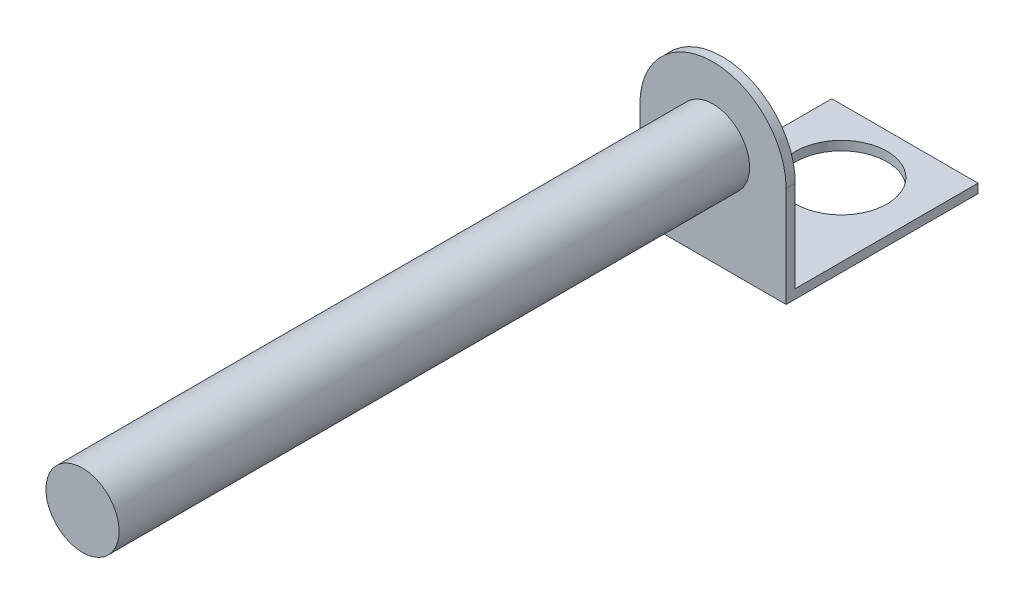
ISO-10303-21;
HEADER;
FILE_DESCRIPTION(('STEP AP214'),'2;1');
FILE_NAME('part.step','',(''),(''),'','','');
FILE_SCHEMA(('AUTOMOTIVE_DESIGN { 1 0 10303 214 1 1 1 1 }'));
ENDSEC;
DATA;
#1=APPLICATION_CONTEXT('core data for automotive mechanical design processes');
#2=APPLICATION_PROTOCOL_DEFINITION('international standard','automotive_design',2000,#1);
#3=PRODUCT_CONTEXT('',#1,'mechanical');
#4=PRODUCT('Part','Part','',(#3));
#5=PRODUCT_RELATED_PRODUCT_CATEGORY('part','',(#4));
#6=PRODUCT_DEFINITION_FORMATION('','',#4);
#7=PRODUCT_DEFINITION_CONTEXT('part definition',#1,'design');
#8=PRODUCT_DEFINITION('design','',#6,#7);
#9=PRODUCT_DEFINITION_SHAPE('','',#8);
#10=(LENGTH_UNIT() NAMED_UNIT(*) SI_UNIT(.MILLI.,.METRE.));
#11=(NAMED_UNIT(*) PLANE_ANGLE_UNIT() SI_UNIT($,.RADIAN.));
#12=(NAMED_UNIT(*) SI_UNIT($,.STERADIAN.) SOLID_ANGLE_UNIT());
#13=UNCERTAINTY_MEASURE_WITH_UNIT(LENGTH_MEASURE(1.E-05),#10,'distance_accuracy_value','');
#14=(GEOMETRIC_REPRESENTATION_CONTEXT(3) GLOBAL_UNCERTAINTY_ASSIGNED_CONTEXT((#13)) GLOBAL_UNIT_ASSIGNED_CONTEXT((#10,
#11,#12)) REPRESENTATION_CONTEXT('',''));
#15=CARTESIAN_POINT('',(0.,0.,0.));
#16=DIRECTION('',(0.,0.,1.));
#17=DIRECTION('',(1.,0.,0.));
#18=AXIS2_PLACEMENT_3D('',#15,#16,#17);
#19=CARTESIAN_POINT('',(0.,0.,69.));
#20=DIRECTION('',(0.,0.,-1.));
#21=DIRECTION('',(-1.,0.,0.));
#22=AXIS2_PLACEMENT_3D('',#19,#20,#21);
#23=CYLINDRICAL_SURFACE('',#22,4.);
#24=CARTESIAN_POINT('',(0.,0.,69.));
#25=DIRECTION('',(0.,0.,1.));
#26=DIRECTION('',(1.,0.,0.));
#27=AXIS2_PLACEMENT_3D('',#24,#25,#26);
#28=CIRCLE('',#27,4.);
#29=CARTESIAN_POINT('',(4.,0.,69.));
#30=VERTEX_POINT('',#29);
#31=EDGE_CURVE('E11',#30,#30,#28,.T.);
#32=ORIENTED_EDGE('',*,*,#31,.F.);
#33=EDGE_LOOP('',(#32));
#34=FACE_BOUND('',#33,.T.);
#35=CARTESIAN_POINT('',(0.,0.,0.));
#36=DIRECTION('',(0.,0.,1.));
#37=DIRECTION('',(1.,0.,0.));
#38=AXIS2_PLACEMENT_3D('',#35,#36,#37);
#39=CIRCLE('',#38,4.);
#40=CARTESIAN_POINT('',(4.,0.,0.));
#41=VERTEX_POINT('',#40);
#42=EDGE_CURVE('E45',#41,#41,#39,.T.);
#43=ORIENTED_EDGE('',*,*,#42,.T.);
#44=EDGE_LOOP('',(#43));
#45=FACE_BOUND('',#44,.T.);
#46=ADVANCED_FACE('F37',(#34,#45),#23,.T.);
#47=CARTESIAN_POINT('',(0.,0.,69.));
#48=DIRECTION('',(0.,0.,1.));
#49=DIRECTION('',(1.,0.,0.));
#50=AXIS2_PLACEMENT_3D('',#47,#48,#49);
#51=PLANE('',#50);
#52=ORIENTED_EDGE('',*,*,#31,.T.);
#53=EDGE_LOOP('',(#52));
#54=FACE_BOUND('',#53,.T.);
#55=ADVANCED_FACE('F184',(#54),#51,.T.);
#56=CARTESIAN_POINT('',(0.,0.,0.));
#57=DIRECTION('',(0.,0.,1.));
#58=DIRECTION('',(1.,0.,0.));
#59=AXIS2_PLACEMENT_3D('',#56,#57,#58);
#60=PLANE('',#59);
#61=CARTESIAN_POINT('',(0.,0.,0.));
#62=DIRECTION('',(0.,0.,-1.));
#63=DIRECTION('',(1.,0.,0.));
#64=AXIS2_PLACEMENT_3D('',#61,#62,#63);
#65=CIRCLE('',#64,8.);
#66=CARTESIAN_POINT('',(-8.,0.,0.));
#67=VERTEX_POINT('',#66);
#68=CARTESIAN_POINT('',(8.,0.,0.));
#69=VERTEX_POINT('',#68);
#70=EDGE_CURVE('E95',#67,#69,#65,.T.);
#71=ORIENTED_EDGE('',*,*,#70,.F.);
#72=DIRECTION('',(0.,1.,0.));
#73=VECTOR('',#72,1.);
#74=CARTESIAN_POINT('',(-8.,-10.,0.));
#75=LINE('',#74,#73);
#76=CARTESIAN_POINT('',(-8.,-11.,0.));
#77=VERTEX_POINT('',#76);
#78=EDGE_CURVE('E75',#77,#67,#75,.T.);
#79=ORIENTED_EDGE('',*,*,#78,.F.);
#80=DIRECTION('',(1.,0.,0.));
#81=VECTOR('',#80,1.);
#82=CARTESIAN_POINT('',(-8.,-11.,0.));
#83=LINE('',#82,#81);
#84=CARTESIAN_POINT('',(8.,-11.,0.));
#85=VERTEX_POINT('',#84);
#86=EDGE_CURVE('E122',#77,#85,#83,.T.);
#87=ORIENTED_EDGE('',*,*,#86,.T.);
#88=DIRECTION('',(0.,-1.,0.));
#89=VECTOR('',#88,1.);
#90=CARTESIAN_POINT('',(8.,0.,0.));
#91=LINE('',#90,#89);
#92=EDGE_CURVE('E89',#69,#85,#91,.T.);
#93=ORIENTED_EDGE('',*,*,#92,.F.);
#94=EDGE_LOOP('',(#71,#79,#87,#93));
#95=FACE_BOUND('',#94,.T.);
#96=ORIENTED_EDGE('',*,*,#42,.F.);
#97=EDGE_LOOP('',(#96));
#98=FACE_BOUND('',#97,.T.);
#99=ADVANCED_FACE('F98',(#95,#98),#60,.T.);
#100=CARTESIAN_POINT('',(0.,0.,-1.));
#101=DIRECTION('',(0.,0.,1.));
#102=DIRECTION('',(1.,0.,0.));
#103=AXIS2_PLACEMENT_3D('',#100,#101,#102);
#104=CYLINDRICAL_SURFACE('',#103,8.);
#105=ORIENTED_EDGE('',*,*,#70,.T.);
#106=DIRECTION('',(0.,0.,1.));
#107=VECTOR('',#106,1.);
#108=CARTESIAN_POINT('',(8.,0.,-1.));
#109=LINE('',#108,#107);
#110=CARTESIAN_POINT('',(8.,0.,-1.));
#111=VERTEX_POINT('',#110);
#112=EDGE_CURVE('E96',#111,#69,#109,.T.);
#113=ORIENTED_EDGE('',*,*,#112,.F.);
#114=CARTESIAN_POINT('',(0.,0.,-1.));
#115=DIRECTION('',(0.,0.,-1.));
#116=DIRECTION('',(1.,0.,0.));
#117=AXIS2_PLACEMENT_3D('',#114,#115,#116);
#118=CIRCLE('',#117,8.);
#119=CARTESIAN_POINT('',(-8.,0.,-1.));
#120=VERTEX_POINT('',#119);
#121=EDGE_CURVE('E88',#120,#111,#118,.T.);
#122=ORIENTED_EDGE('',*,*,#121,.F.);
#123=DIRECTION('',(0.,0.,1.));
#124=VECTOR('',#123,1.);
#125=CARTESIAN_POINT('',(-8.,0.,-1.));
#126=LINE('',#125,#124);
#127=EDGE_CURVE('E78',#120,#67,#126,.T.);
#128=ORIENTED_EDGE('',*,*,#127,.T.);
#129=EDGE_LOOP('',(#105,#113,#122,#128));
#130=FACE_BOUND('',#129,.T.);
#131=ADVANCED_FACE('F93',(#130),#104,.T.);
#132=CARTESIAN_POINT('',(8.,0.,-1.));
#133=DIRECTION('',(-1.,0.,0.));
#134=DIRECTION('',(0.,0.,1.));
#135=AXIS2_PLACEMENT_3D('',#132,#133,#134);
#136=PLANE('',#135);
#137=ORIENTED_EDGE('',*,*,#92,.T.);
#138=DIRECTION('',(0.,0.,-1.));
#139=VECTOR('',#138,1.);
#140=CARTESIAN_POINT('',(8.,-11.,0.));
#141=LINE('',#140,#139);
#142=CARTESIAN_POINT('',(8.,-11.,-21.));
#143=VERTEX_POINT('',#142);
#144=EDGE_CURVE('E104',#85,#143,#141,.T.);
#145=ORIENTED_EDGE('',*,*,#144,.T.);
#146=DIRECTION('',(0.,1.,0.));
#147=VECTOR('',#146,1.);
#148=CARTESIAN_POINT('',(8.,-11.,-21.));
#149=LINE('',#148,#147);
#150=CARTESIAN_POINT('',(8.,-10.,-21.));
#151=VERTEX_POINT('',#150);
#152=EDGE_CURVE('E127',#143,#151,#149,.T.);
#153=ORIENTED_EDGE('',*,*,#152,.T.);
#154=DIRECTION('',(0.,0.,1.));
#155=VECTOR('',#154,1.);
#156=CARTESIAN_POINT('',(8.,-10.,-1.));
#157=LINE('',#156,#155);
#158=CARTESIAN_POINT('',(8.,-10.,-1.));
#159=VERTEX_POINT('',#158);
#160=EDGE_CURVE('E138',#151,#159,#157,.T.);
#161=ORIENTED_EDGE('',*,*,#160,.T.);
#162=DIRECTION('',(0.,-1.,0.));
#163=VECTOR('',#162,1.);
#164=CARTESIAN_POINT('',(8.,0.,-1.));
#165=LINE('',#164,#163);
#166=EDGE_CURVE('E113',#111,#159,#165,.T.);
#167=ORIENTED_EDGE('',*,*,#166,.F.);
#168=ORIENTED_EDGE('',*,*,#112,.T.);
#169=EDGE_LOOP('',(#137,#145,#153,#161,#167,#168));
#170=FACE_BOUND('',#169,.T.);
#171=ADVANCED_FACE('F166',(#170),#136,.F.);
#172=CARTESIAN_POINT('',(-8.,-10.,-1.));
#173=DIRECTION('',(1.,0.,0.));
#174=DIRECTION('',(0.,1.,0.));
#175=AXIS2_PLACEMENT_3D('',#172,#173,#174);
#176=PLANE('',#175);
#177=ORIENTED_EDGE('',*,*,#78,.T.);
#178=ORIENTED_EDGE('',*,*,#127,.F.);
#179=DIRECTION('',(0.,1.,0.));
#180=VECTOR('',#179,1.);
#181=CARTESIAN_POINT('',(-8.,-10.,-1.));
#182=LINE('',#181,#180);
#183=CARTESIAN_POINT('',(-8.,-10.,-1.));
#184=VERTEX_POINT('',#183);
#185=EDGE_CURVE('E61',#184,#120,#182,.T.);
#186=ORIENTED_EDGE('',*,*,#185,.F.);
#187=DIRECTION('',(0.,0.,-1.));
#188=VECTOR('',#187,1.);
#189=CARTESIAN_POINT('',(-8.,-10.,-21.));
#190=LINE('',#189,#188);
#191=CARTESIAN_POINT('',(-8.,-10.,-21.));
#192=VERTEX_POINT('',#191);
#193=EDGE_CURVE('E53',#184,#192,#190,.T.);
#194=ORIENTED_EDGE('',*,*,#193,.T.);
#195=DIRECTION('',(0.,1.,0.));
#196=VECTOR('',#195,1.);
#197=CARTESIAN_POINT('',(-8.,-11.,-21.));
#198=LINE('',#197,#196);
#199=CARTESIAN_POINT('',(-8.,-11.,-21.));
#200=VERTEX_POINT('',#199);
#201=EDGE_CURVE('E124',#200,#192,#198,.T.);
#202=ORIENTED_EDGE('',*,*,#201,.F.);
#203=DIRECTION('',(0.,0.,-1.));
#204=VECTOR('',#203,1.);
#205=CARTESIAN_POINT('',(-8.,-11.,0.));
#206=LINE('',#205,#204);
#207=EDGE_CURVE('E83',#77,#200,#206,.T.);
#208=ORIENTED_EDGE('',*,*,#207,.F.);
#209=EDGE_LOOP('',(#177,#178,#186,#194,#202,#208));
#210=FACE_BOUND('',#209,.T.);
#211=ADVANCED_FACE('F77',(#210),#176,.F.);
#212=CARTESIAN_POINT('',(0.,0.,-1.));
#213=DIRECTION('',(0.,0.,1.));
#214=DIRECTION('',(1.,0.,0.));
#215=AXIS2_PLACEMENT_3D('',#212,#213,#214);
#216=PLANE('',#215);
#217=ORIENTED_EDGE('',*,*,#166,.T.);
#218=DIRECTION('',(-1.,0.,0.));
#219=VECTOR('',#218,1.);
#220=CARTESIAN_POINT('',(-8.,-10.,-1.));
#221=LINE('',#220,#219);
#222=EDGE_CURVE('E136',#159,#184,#221,.T.);
#223=ORIENTED_EDGE('',*,*,#222,.T.);
#224=ORIENTED_EDGE('',*,*,#185,.T.);
#225=ORIENTED_EDGE('',*,*,#121,.T.);
#226=EDGE_LOOP('',(#217,#223,#224,#225));
#227=FACE_BOUND('',#226,.T.);
#228=ADVANCED_FACE('F170',(#227),#216,.F.);
#229=CARTESIAN_POINT('',(-8.,-11.,0.));
#230=DIRECTION('',(0.,1.,0.));
#231=DIRECTION('',(0.,0.,1.));
#232=AXIS2_PLACEMENT_3D('',#229,#230,#231);
#233=PLANE('',#232);
#234=CARTESIAN_POINT('',(0.,-11.,-14.0461886805654));
#235=DIRECTION('',(0.,1.,0.));
#236=DIRECTION('',(0.,0.,1.));
#237=AXIS2_PLACEMENT_3D('',#234,#235,#236);
#238=CIRCLE('',#237,5.);
#239=CARTESIAN_POINT('',(0.,-11.,-9.04618868056542));
#240=VERTEX_POINT('',#239);
#241=EDGE_CURVE('E148',#240,#240,#238,.T.);
#242=ORIENTED_EDGE('',*,*,#241,.T.);
#243=EDGE_LOOP('',(#242));
#244=FACE_BOUND('',#243,.T.);
#245=ORIENTED_EDGE('',*,*,#207,.T.);
#246=DIRECTION('',(1.,0.,0.));
#247=VECTOR('',#246,1.);
#248=CARTESIAN_POINT('',(8.,-11.,-21.));
#249=LINE('',#248,#247);
#250=EDGE_CURVE('E130',#200,#143,#249,.T.);
#251=ORIENTED_EDGE('',*,*,#250,.T.);
#252=ORIENTED_EDGE('',*,*,#144,.F.);
#253=ORIENTED_EDGE('',*,*,#86,.F.);
#254=EDGE_LOOP('',(#245,#251,#252,#253));
#255=FACE_BOUND('',#254,.T.);
#256=ADVANCED_FACE('F162',(#244,#255),#233,.F.);
#257=CARTESIAN_POINT('',(8.,-11.,-21.));
#258=DIRECTION('',(0.,0.,1.));
#259=DIRECTION('',(1.,0.,0.));
#260=AXIS2_PLACEMENT_3D('',#257,#258,#259);
#261=PLANE('',#260);
#262=DIRECTION('',(1.,0.,0.));
#263=VECTOR('',#262,1.);
#264=CARTESIAN_POINT('',(8.,-10.,-21.));
#265=LINE('',#264,#263);
#266=EDGE_CURVE('E133',#192,#151,#265,.T.);
#267=ORIENTED_EDGE('',*,*,#266,.T.);
#268=ORIENTED_EDGE('',*,*,#152,.F.);
#269=ORIENTED_EDGE('',*,*,#250,.F.);
#270=ORIENTED_EDGE('',*,*,#201,.T.);
#271=EDGE_LOOP('',(#267,#268,#269,#270));
#272=FACE_BOUND('',#271,.T.);
#273=ADVANCED_FACE('F165',(#272),#261,.F.);
#274=CARTESIAN_POINT('',(0.,-10.,0.));
#275=DIRECTION('',(0.,1.,0.));
#276=DIRECTION('',(0.,0.,1.));
#277=AXIS2_PLACEMENT_3D('',#274,#275,#276);
#278=PLANE('',#277);
#279=CARTESIAN_POINT('',(0.,-10.,-14.0461886805654));
#280=DIRECTION('',(0.,1.,0.));
#281=DIRECTION('',(0.,0.,1.));
#282=AXIS2_PLACEMENT_3D('',#279,#280,#281);
#283=CIRCLE('',#282,5.);
#284=CARTESIAN_POINT('',(0.,-10.,-9.04618868056542));
#285=VERTEX_POINT('',#284);
#286=EDGE_CURVE('E151',#285,#285,#283,.T.);
#287=ORIENTED_EDGE('',*,*,#286,.F.);
#288=EDGE_LOOP('',(#287));
#289=FACE_BOUND('',#288,.T.);
#290=ORIENTED_EDGE('',*,*,#193,.F.);
#291=ORIENTED_EDGE('',*,*,#222,.F.);
#292=ORIENTED_EDGE('',*,*,#160,.F.);
#293=ORIENTED_EDGE('',*,*,#266,.F.);
#294=EDGE_LOOP('',(#290,#291,#292,#293));
#295=FACE_BOUND('',#294,.T.);
#296=ADVANCED_FACE('F168',(#289,#295),#278,.T.);
#297=CARTESIAN_POINT('',(0.,-11.,-14.0461886805654));
#298=DIRECTION('',(0.,1.,0.));
#299=DIRECTION('',(0.,0.,1.));
#300=AXIS2_PLACEMENT_3D('',#297,#298,#299);
#301=CYLINDRICAL_SURFACE('',#300,5.);
#302=ORIENTED_EDGE('',*,*,#241,.F.);
#303=EDGE_LOOP('',(#302));
#304=FACE_BOUND('',#303,.T.);
#305=ORIENTED_EDGE('',*,*,#286,.T.);
#306=EDGE_LOOP('',(#305));
#307=FACE_BOUND('',#306,.T.);
#308=ADVANCED_FACE('F239',(#304,#307),#301,.F.);
#309=CLOSED_SHELL('',(#46,#55,#99,#131,#171,#211,#228,#256,#273,#296,#308));
#310=MANIFOLD_SOLID_BREP('B2',#309);
#311=ADVANCED_BREP_SHAPE_REPRESENTATION('',(#18,#310),#14);
#312=SHAPE_DEFINITION_REPRESENTATION(#9,#311);
ENDSEC;
END-ISO-10303-21;
